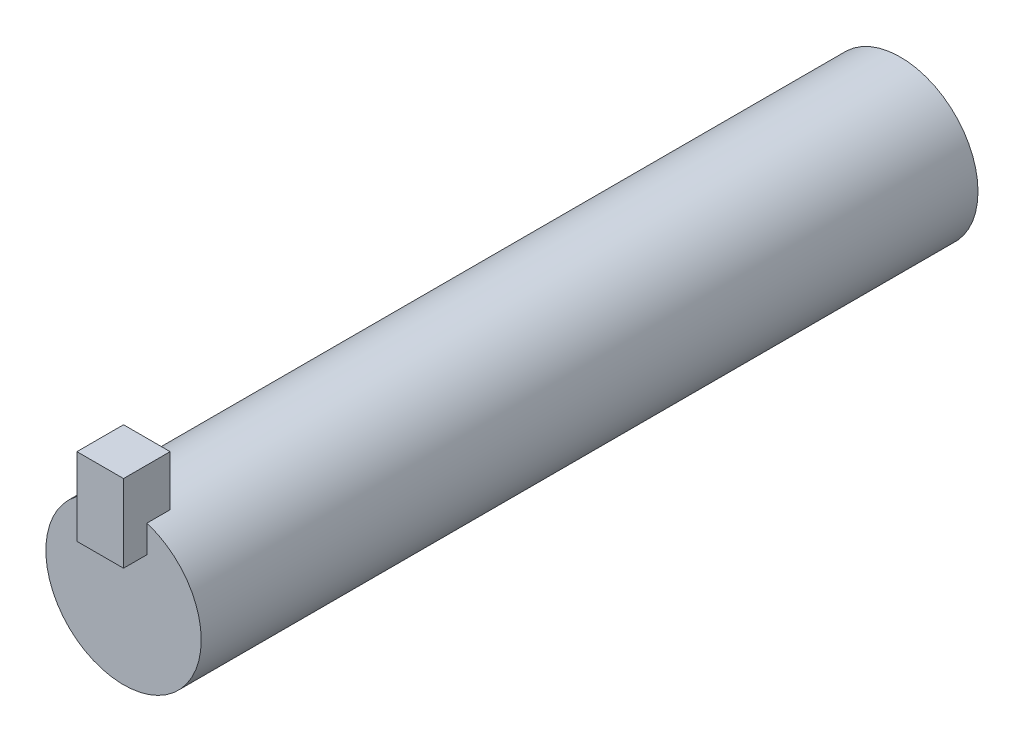
ISO-10303-21;
HEADER;
FILE_DESCRIPTION(('STEP AP214'),'2;1');
FILE_NAME('part.step','',(''),(''),'','','');
FILE_SCHEMA(('AUTOMOTIVE_DESIGN { 1 0 10303 214 1 1 1 1 }'));
ENDSEC;
DATA;
#1=APPLICATION_CONTEXT('core data for automotive mechanical design processes');
#2=APPLICATION_PROTOCOL_DEFINITION('international standard','automotive_design',2000,#1);
#3=PRODUCT_CONTEXT('',#1,'mechanical');
#4=PRODUCT('Part','Part','',(#3));
#5=PRODUCT_RELATED_PRODUCT_CATEGORY('part','',(#4));
#6=PRODUCT_DEFINITION_FORMATION('','',#4);
#7=PRODUCT_DEFINITION_CONTEXT('part definition',#1,'design');
#8=PRODUCT_DEFINITION('design','',#6,#7);
#9=PRODUCT_DEFINITION_SHAPE('','',#8);
#10=(LENGTH_UNIT() NAMED_UNIT(*) SI_UNIT(.MILLI.,.METRE.));
#11=(NAMED_UNIT(*) PLANE_ANGLE_UNIT() SI_UNIT($,.RADIAN.));
#12=(NAMED_UNIT(*) SI_UNIT($,.STERADIAN.) SOLID_ANGLE_UNIT());
#13=UNCERTAINTY_MEASURE_WITH_UNIT(LENGTH_MEASURE(1.E-05),#10,'distance_accuracy_value','');
#14=(GEOMETRIC_REPRESENTATION_CONTEXT(3) GLOBAL_UNCERTAINTY_ASSIGNED_CONTEXT((#13)) GLOBAL_UNIT_ASSIGNED_CONTEXT((#10,
#11,#12)) REPRESENTATION_CONTEXT('',''));
#15=CARTESIAN_POINT('',(0.,0.,0.));
#16=DIRECTION('',(0.,0.,1.));
#17=DIRECTION('',(1.,0.,0.));
#18=AXIS2_PLACEMENT_3D('',#15,#16,#17);
#19=CARTESIAN_POINT('',(1.5,3.,48.5));
#20=DIRECTION('',(1.,0.,0.));
#21=DIRECTION('',(0.,0.,-1.));
#22=AXIS2_PLACEMENT_3D('',#19,#20,#21);
#23=PLANE('',#22);
#24=DIRECTION('',(0.,1.,0.));
#25=VECTOR('',#24,1.);
#26=CARTESIAN_POINT('',(1.5,3.,48.5));
#27=LINE('',#26,#25);
#28=CARTESIAN_POINT('',(1.5,3.,48.5));
#29=VERTEX_POINT('',#28);
#30=CARTESIAN_POINT('',(1.5,8.,48.5));
#31=VERTEX_POINT('',#30);
#32=EDGE_CURVE('E44',#29,#31,#27,.T.);
#33=ORIENTED_EDGE('',*,*,#32,.T.);
#34=DIRECTION('',(0.,0.,-1.));
#35=VECTOR('',#34,1.);
#36=CARTESIAN_POINT('',(1.5,8.,48.5));
#37=LINE('',#36,#35);
#38=CARTESIAN_POINT('',(1.5,8.,51.5));
#39=VERTEX_POINT('',#38);
#40=EDGE_CURVE('E81',#39,#31,#37,.T.);
#41=ORIENTED_EDGE('',*,*,#40,.F.);
#42=DIRECTION('',(0.,1.,0.));
#43=VECTOR('',#42,1.);
#44=CARTESIAN_POINT('',(1.5,3.,51.5));
#45=LINE('',#44,#43);
#46=CARTESIAN_POINT('',(1.5,3.,51.5));
#47=VERTEX_POINT('',#46);
#48=EDGE_CURVE('E12',#47,#39,#45,.T.);
#49=ORIENTED_EDGE('',*,*,#48,.F.);
#50=DIRECTION('',(0.,0.,-1.));
#51=VECTOR('',#50,1.);
#52=CARTESIAN_POINT('',(1.5,3.,48.5));
#53=LINE('',#52,#51);
#54=EDGE_CURVE('E82',#47,#29,#53,.T.);
#55=ORIENTED_EDGE('',*,*,#54,.T.);
#56=EDGE_LOOP('',(#33,#41,#49,#55));
#57=FACE_BOUND('',#56,.T.);
#58=ADVANCED_FACE('F41',(#57),#23,.T.);
#59=CARTESIAN_POINT('',(-1.50000000000001,3.,51.5));
#60=DIRECTION('',(0.,0.,1.));
#61=DIRECTION('',(1.,0.,0.));
#62=AXIS2_PLACEMENT_3D('',#59,#60,#61);
#63=PLANE('',#62);
#64=ORIENTED_EDGE('',*,*,#48,.T.);
#65=DIRECTION('',(1.,0.,0.));
#66=VECTOR('',#65,1.);
#67=CARTESIAN_POINT('',(-1.50000000000001,8.,51.5));
#68=LINE('',#67,#66);
#69=CARTESIAN_POINT('',(-1.50000000000001,8.,51.5));
#70=VERTEX_POINT('',#69);
#71=EDGE_CURVE('E98',#70,#39,#68,.T.);
#72=ORIENTED_EDGE('',*,*,#71,.F.);
#73=DIRECTION('',(0.,1.,0.));
#74=VECTOR('',#73,1.);
#75=CARTESIAN_POINT('',(-1.50000000000001,3.,51.5));
#76=LINE('',#75,#74);
#77=CARTESIAN_POINT('',(-1.50000000000001,3.,51.5));
#78=VERTEX_POINT('',#77);
#79=EDGE_CURVE('E49',#78,#70,#76,.T.);
#80=ORIENTED_EDGE('',*,*,#79,.F.);
#81=DIRECTION('',(1.,0.,0.));
#82=VECTOR('',#81,1.);
#83=CARTESIAN_POINT('',(-1.50000000000001,3.,51.5));
#84=LINE('',#83,#82);
#85=EDGE_CURVE('E87',#78,#47,#84,.T.);
#86=ORIENTED_EDGE('',*,*,#85,.T.);
#87=EDGE_LOOP('',(#64,#72,#80,#86));
#88=FACE_BOUND('',#87,.T.);
#89=ADVANCED_FACE('F113',(#88),#63,.T.);
#90=CARTESIAN_POINT('',(-1.50000000000001,3.,48.5));
#91=DIRECTION('',(-1.,0.,0.));
#92=DIRECTION('',(0.,0.,1.));
#93=AXIS2_PLACEMENT_3D('',#90,#91,#92);
#94=PLANE('',#93);
#95=ORIENTED_EDGE('',*,*,#79,.T.);
#96=DIRECTION('',(0.,0.,1.));
#97=VECTOR('',#96,1.);
#98=CARTESIAN_POINT('',(-1.50000000000001,8.,48.5));
#99=LINE('',#98,#97);
#100=CARTESIAN_POINT('',(-1.50000000000001,8.,48.5));
#101=VERTEX_POINT('',#100);
#102=EDGE_CURVE('E94',#101,#70,#99,.T.);
#103=ORIENTED_EDGE('',*,*,#102,.F.);
#104=DIRECTION('',(0.,1.,0.));
#105=VECTOR('',#104,1.);
#106=CARTESIAN_POINT('',(-1.50000000000001,3.,48.5));
#107=LINE('',#106,#105);
#108=CARTESIAN_POINT('',(-1.50000000000001,3.,48.5));
#109=VERTEX_POINT('',#108);
#110=EDGE_CURVE('E86',#109,#101,#107,.T.);
#111=ORIENTED_EDGE('',*,*,#110,.F.);
#112=DIRECTION('',(0.,0.,1.));
#113=VECTOR('',#112,1.);
#114=CARTESIAN_POINT('',(-1.50000000000001,3.,48.5));
#115=LINE('',#114,#113);
#116=EDGE_CURVE('E106',#109,#78,#115,.T.);
#117=ORIENTED_EDGE('',*,*,#116,.T.);
#118=EDGE_LOOP('',(#95,#103,#111,#117));
#119=FACE_BOUND('',#118,.T.);
#120=ADVANCED_FACE('F110',(#119),#94,.T.);
#121=CARTESIAN_POINT('',(-1.50000000000001,3.,48.5));
#122=DIRECTION('',(0.,0.,-1.));
#123=DIRECTION('',(-1.,0.,0.));
#124=AXIS2_PLACEMENT_3D('',#121,#122,#123);
#125=PLANE('',#124);
#126=ORIENTED_EDGE('',*,*,#110,.T.);
#127=DIRECTION('',(-1.,0.,0.));
#128=VECTOR('',#127,1.);
#129=CARTESIAN_POINT('',(-1.50000000000001,8.,48.5));
#130=LINE('',#129,#128);
#131=EDGE_CURVE('E89',#31,#101,#130,.T.);
#132=ORIENTED_EDGE('',*,*,#131,.F.);
#133=ORIENTED_EDGE('',*,*,#32,.F.);
#134=DIRECTION('',(-1.,0.,0.));
#135=VECTOR('',#134,1.);
#136=CARTESIAN_POINT('',(-1.50000000000001,3.,48.5));
#137=LINE('',#136,#135);
#138=EDGE_CURVE('E104',#29,#109,#137,.T.);
#139=ORIENTED_EDGE('',*,*,#138,.T.);
#140=EDGE_LOOP('',(#126,#132,#133,#139));
#141=FACE_BOUND('',#140,.T.);
#142=ADVANCED_FACE('F90',(#141),#125,.T.);
#143=CARTESIAN_POINT('',(0.,3.,0.));
#144=DIRECTION('',(0.,1.,0.));
#145=DIRECTION('',(0.,0.,1.));
#146=AXIS2_PLACEMENT_3D('',#143,#144,#145);
#147=PLANE('',#146);
#148=ORIENTED_EDGE('',*,*,#54,.F.);
#149=ORIENTED_EDGE('',*,*,#85,.F.);
#150=ORIENTED_EDGE('',*,*,#116,.F.);
#151=ORIENTED_EDGE('',*,*,#138,.F.);
#152=EDGE_LOOP('',(#148,#149,#150,#151));
#153=FACE_BOUND('',#152,.T.);
#154=ADVANCED_FACE('F115',(#153),#147,.F.);
#155=CARTESIAN_POINT('',(0.,8.,0.));
#156=DIRECTION('',(0.,1.,0.));
#157=DIRECTION('',(0.,0.,1.));
#158=AXIS2_PLACEMENT_3D('',#155,#156,#157);
#159=PLANE('',#158);
#160=ORIENTED_EDGE('',*,*,#40,.T.);
#161=ORIENTED_EDGE('',*,*,#131,.T.);
#162=ORIENTED_EDGE('',*,*,#102,.T.);
#163=ORIENTED_EDGE('',*,*,#71,.T.);
#164=EDGE_LOOP('',(#160,#161,#162,#163));
#165=FACE_BOUND('',#164,.T.);
#166=ADVANCED_FACE('F97',(#165),#159,.T.);
#167=CLOSED_SHELL('',(#58,#89,#120,#142,#154,#166));
#168=MANIFOLD_SOLID_BREP('B2',#167);
#169=CARTESIAN_POINT('',(0.,0.,50.));
#170=DIRECTION('',(0.,0.,-1.));
#171=DIRECTION('',(-1.,0.,0.));
#172=AXIS2_PLACEMENT_3D('',#169,#170,#171);
#173=CYLINDRICAL_SURFACE('',#172,5.);
#174=CARTESIAN_POINT('',(0.,0.,50.));
#175=DIRECTION('',(0.,0.,1.));
#176=DIRECTION('',(1.,0.,0.));
#177=AXIS2_PLACEMENT_3D('',#174,#175,#176);
#178=CIRCLE('',#177,5.);
#179=CARTESIAN_POINT('',(5.,0.,50.));
#180=VERTEX_POINT('',#179);
#181=EDGE_CURVE('E40',#180,#180,#178,.T.);
#182=ORIENTED_EDGE('',*,*,#181,.F.);
#183=EDGE_LOOP('',(#182));
#184=FACE_BOUND('',#183,.T.);
#185=CARTESIAN_POINT('',(0.,0.,0.));
#186=DIRECTION('',(0.,0.,1.));
#187=DIRECTION('',(1.,0.,0.));
#188=AXIS2_PLACEMENT_3D('',#185,#186,#187);
#189=CIRCLE('',#188,5.);
#190=CARTESIAN_POINT('',(5.,0.,0.));
#191=VERTEX_POINT('',#190);
#192=EDGE_CURVE('E168',#191,#191,#189,.T.);
#193=ORIENTED_EDGE('',*,*,#192,.T.);
#194=EDGE_LOOP('',(#193));
#195=FACE_BOUND('',#194,.T.);
#196=ADVANCED_FACE('F165',(#184,#195),#173,.T.);
#197=CARTESIAN_POINT('',(0.,0.,50.));
#198=DIRECTION('',(0.,0.,1.));
#199=DIRECTION('',(1.,0.,0.));
#200=AXIS2_PLACEMENT_3D('',#197,#198,#199);
#201=PLANE('',#200);
#202=ORIENTED_EDGE('',*,*,#181,.T.);
#203=EDGE_LOOP('',(#202));
#204=FACE_BOUND('',#203,.T.);
#205=ADVANCED_FACE('F180',(#204),#201,.T.);
#206=CARTESIAN_POINT('',(0.,0.,0.));
#207=DIRECTION('',(0.,0.,1.));
#208=DIRECTION('',(1.,0.,0.));
#209=AXIS2_PLACEMENT_3D('',#206,#207,#208);
#210=PLANE('',#209);
#211=ORIENTED_EDGE('',*,*,#192,.F.);
#212=EDGE_LOOP('',(#211));
#213=FACE_BOUND('',#212,.T.);
#214=ADVANCED_FACE('F178',(#213),#210,.F.);
#215=CLOSED_SHELL('',(#196,#205,#214));
#216=MANIFOLD_SOLID_BREP('B6',#215);
#217=ADVANCED_BREP_SHAPE_REPRESENTATION('',(#18,#168,#216),#14);
#218=SHAPE_DEFINITION_REPRESENTATION(#9,#217);
ENDSEC;
END-ISO-10303-21;
